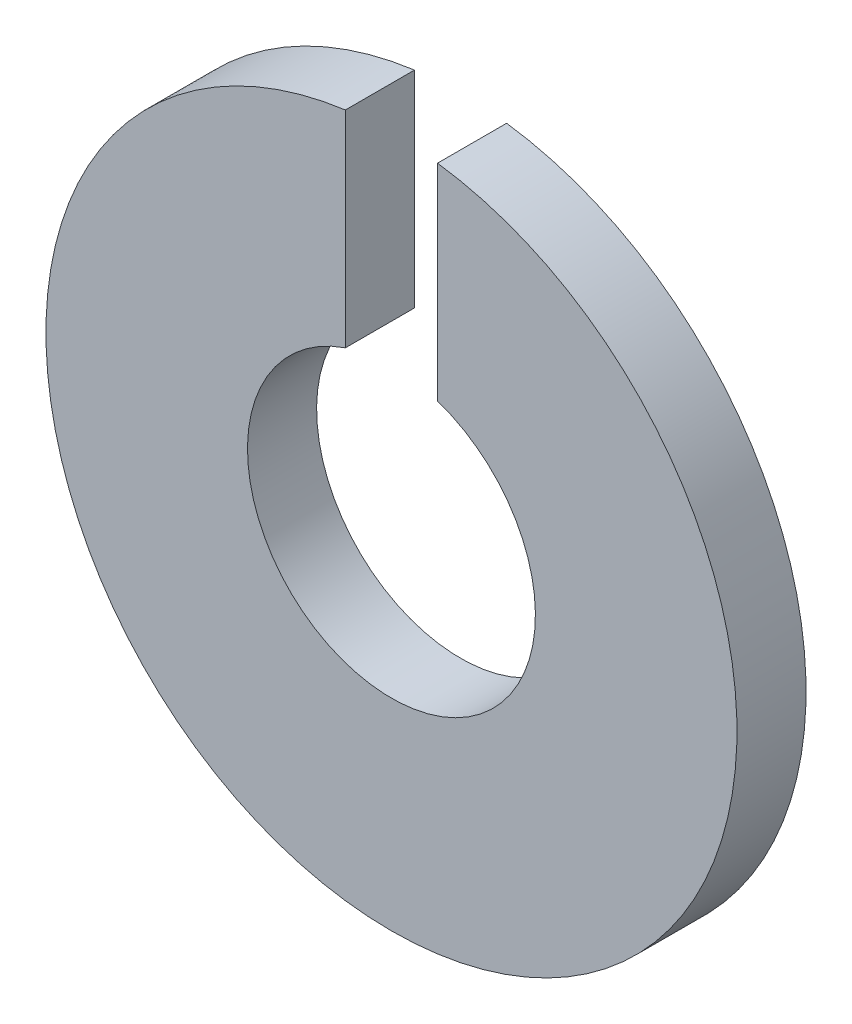
ISO-10303-21;
HEADER;
FILE_DESCRIPTION(('STEP AP214'),'2;1');
FILE_NAME('part.step','',(''),(''),'','','');
FILE_SCHEMA(('AUTOMOTIVE_DESIGN { 1 0 10303 214 1 1 1 1 }'));
ENDSEC;
DATA;
#1=APPLICATION_CONTEXT('core data for automotive mechanical design processes');
#2=APPLICATION_PROTOCOL_DEFINITION('international standard','automotive_design',2000,#1);
#3=PRODUCT_CONTEXT('',#1,'mechanical');
#4=PRODUCT('Part','Part','',(#3));
#5=PRODUCT_RELATED_PRODUCT_CATEGORY('part','',(#4));
#6=PRODUCT_DEFINITION_FORMATION('','',#4);
#7=PRODUCT_DEFINITION_CONTEXT('part definition',#1,'design');
#8=PRODUCT_DEFINITION('design','',#6,#7);
#9=PRODUCT_DEFINITION_SHAPE('','',#8);
#10=(LENGTH_UNIT() NAMED_UNIT(*) SI_UNIT(.MILLI.,.METRE.));
#11=(NAMED_UNIT(*) PLANE_ANGLE_UNIT() SI_UNIT($,.RADIAN.));
#12=(NAMED_UNIT(*) SI_UNIT($,.STERADIAN.) SOLID_ANGLE_UNIT());
#13=UNCERTAINTY_MEASURE_WITH_UNIT(LENGTH_MEASURE(1.E-05),#10,'distance_accuracy_value','');
#14=(GEOMETRIC_REPRESENTATION_CONTEXT(3) GLOBAL_UNCERTAINTY_ASSIGNED_CONTEXT((#13)) GLOBAL_UNIT_ASSIGNED_CONTEXT((#10,
#11,#12)) REPRESENTATION_CONTEXT('',''));
#15=CARTESIAN_POINT('',(0.,0.,0.));
#16=DIRECTION('',(0.,0.,1.));
#17=DIRECTION('',(1.,0.,0.));
#18=AXIS2_PLACEMENT_3D('',#15,#16,#17);
#19=CARTESIAN_POINT('',(0.,0.,6.));
#20=DIRECTION('',(0.,0.,1.));
#21=DIRECTION('',(1.,0.,0.));
#22=AXIS2_PLACEMENT_3D('',#19,#20,#21);
#23=PLANE('',#22);
#24=DIRECTION('',(0.,-1.,0.));
#25=VECTOR('',#24,1.);
#26=CARTESIAN_POINT('',(-4.00000000000001,0.,6.));
#27=LINE('',#26,#25);
#28=CARTESIAN_POINT('',(-4.00000000000001,29.732137494637,6.));
#29=VERTEX_POINT('',#28);
#30=CARTESIAN_POINT('',(-4.00000000000001,11.842719282327,6.));
#31=VERTEX_POINT('',#30);
#32=EDGE_CURVE('E63',#29,#31,#27,.T.);
#33=ORIENTED_EDGE('',*,*,#32,.F.);
#34=CARTESIAN_POINT('',(0.,0.,6.));
#35=DIRECTION('',(0.,0.,1.));
#36=DIRECTION('',(1.,0.,0.));
#37=AXIS2_PLACEMENT_3D('',#34,#35,#36);
#38=CIRCLE('',#37,30.);
#39=CARTESIAN_POINT('',(4.,29.732137494637,6.));
#40=VERTEX_POINT('',#39);
#41=EDGE_CURVE('E94',#29,#40,#38,.T.);
#42=ORIENTED_EDGE('',*,*,#41,.T.);
#43=DIRECTION('',(0.,1.,0.));
#44=VECTOR('',#43,1.);
#45=CARTESIAN_POINT('',(4.00000000000001,0.,6.));
#46=LINE('',#45,#44);
#47=CARTESIAN_POINT('',(4.,11.842719282327,6.));
#48=VERTEX_POINT('',#47);
#49=EDGE_CURVE('E97',#48,#40,#46,.T.);
#50=ORIENTED_EDGE('',*,*,#49,.F.);
#51=CARTESIAN_POINT('',(0.,0.,6.));
#52=DIRECTION('',(0.,0.,1.));
#53=DIRECTION('',(1.,0.,0.));
#54=AXIS2_PLACEMENT_3D('',#51,#52,#53);
#55=CIRCLE('',#54,12.5);
#56=EDGE_CURVE('E96',#31,#48,#55,.T.);
#57=ORIENTED_EDGE('',*,*,#56,.F.);
#58=EDGE_LOOP('',(#33,#42,#50,#57));
#59=FACE_BOUND('',#58,.T.);
#60=ADVANCED_FACE('F41',(#59),#23,.T.);
#61=CARTESIAN_POINT('',(0.,0.,0.));
#62=DIRECTION('',(0.,0.,1.));
#63=DIRECTION('',(1.,0.,0.));
#64=AXIS2_PLACEMENT_3D('',#61,#62,#63);
#65=PLANE('',#64);
#66=CARTESIAN_POINT('',(0.,0.,0.));
#67=DIRECTION('',(0.,0.,1.));
#68=DIRECTION('',(1.,0.,0.));
#69=AXIS2_PLACEMENT_3D('',#66,#67,#68);
#70=CIRCLE('',#69,30.);
#71=CARTESIAN_POINT('',(-4.00000000000001,29.732137494637,0.));
#72=VERTEX_POINT('',#71);
#73=CARTESIAN_POINT('',(4.,29.732137494637,0.));
#74=VERTEX_POINT('',#73);
#75=EDGE_CURVE('E100',#72,#74,#70,.T.);
#76=ORIENTED_EDGE('',*,*,#75,.F.);
#77=DIRECTION('',(0.,-1.,0.));
#78=VECTOR('',#77,1.);
#79=CARTESIAN_POINT('',(-4.00000000000001,0.,0.));
#80=LINE('',#79,#78);
#81=CARTESIAN_POINT('',(-4.00000000000001,11.842719282327,0.));
#82=VERTEX_POINT('',#81);
#83=EDGE_CURVE('E82',#72,#82,#80,.T.);
#84=ORIENTED_EDGE('',*,*,#83,.T.);
#85=CARTESIAN_POINT('',(0.,0.,0.));
#86=DIRECTION('',(0.,0.,1.));
#87=DIRECTION('',(1.,0.,0.));
#88=AXIS2_PLACEMENT_3D('',#85,#86,#87);
#89=CIRCLE('',#88,12.5);
#90=CARTESIAN_POINT('',(4.,11.842719282327,0.));
#91=VERTEX_POINT('',#90);
#92=EDGE_CURVE('E87',#82,#91,#89,.T.);
#93=ORIENTED_EDGE('',*,*,#92,.T.);
#94=DIRECTION('',(0.,1.,0.));
#95=VECTOR('',#94,1.);
#96=CARTESIAN_POINT('',(4.00000000000001,0.,0.));
#97=LINE('',#96,#95);
#98=EDGE_CURVE('E56',#91,#74,#97,.T.);
#99=ORIENTED_EDGE('',*,*,#98,.T.);
#100=EDGE_LOOP('',(#76,#84,#93,#99));
#101=FACE_BOUND('',#100,.T.);
#102=ADVANCED_FACE('F112',(#101),#65,.F.);
#103=CARTESIAN_POINT('',(0.,0.,6.));
#104=DIRECTION('',(0.,0.,-1.));
#105=DIRECTION('',(-1.,0.,0.));
#106=AXIS2_PLACEMENT_3D('',#103,#104,#105);
#107=CYLINDRICAL_SURFACE('',#106,30.);
#108=ORIENTED_EDGE('',*,*,#41,.F.);
#109=DIRECTION('',(0.,0.,-1.));
#110=VECTOR('',#109,1.);
#111=CARTESIAN_POINT('',(-4.00000000000001,29.732137494637,6.));
#112=LINE('',#111,#110);
#113=EDGE_CURVE('E79',#29,#72,#112,.T.);
#114=ORIENTED_EDGE('',*,*,#113,.T.);
#115=ORIENTED_EDGE('',*,*,#75,.T.);
#116=DIRECTION('',(0.,0.,-1.));
#117=VECTOR('',#116,1.);
#118=CARTESIAN_POINT('',(4.,29.732137494637,6.));
#119=LINE('',#118,#117);
#120=EDGE_CURVE('E88',#74,#40,#119,.F.);
#121=ORIENTED_EDGE('',*,*,#120,.T.);
#122=EDGE_LOOP('',(#108,#114,#115,#121));
#123=FACE_BOUND('',#122,.T.);
#124=ADVANCED_FACE('F43',(#123),#107,.T.);
#125=CARTESIAN_POINT('',(0.,0.,6.));
#126=DIRECTION('',(0.,0.,-1.));
#127=DIRECTION('',(-1.,0.,0.));
#128=AXIS2_PLACEMENT_3D('',#125,#126,#127);
#129=CYLINDRICAL_SURFACE('',#128,12.5);
#130=DIRECTION('',(0.,0.,-1.));
#131=VECTOR('',#130,1.);
#132=CARTESIAN_POINT('',(-4.00000000000001,11.842719282327,6.));
#133=LINE('',#132,#131);
#134=EDGE_CURVE('E11',#31,#82,#133,.T.);
#135=ORIENTED_EDGE('',*,*,#134,.F.);
#136=ORIENTED_EDGE('',*,*,#56,.T.);
#137=DIRECTION('',(0.,0.,-1.));
#138=VECTOR('',#137,1.);
#139=CARTESIAN_POINT('',(4.,11.842719282327,6.));
#140=LINE('',#139,#138);
#141=EDGE_CURVE('E49',#91,#48,#140,.F.);
#142=ORIENTED_EDGE('',*,*,#141,.F.);
#143=ORIENTED_EDGE('',*,*,#92,.F.);
#144=EDGE_LOOP('',(#135,#136,#142,#143));
#145=FACE_BOUND('',#144,.T.);
#146=ADVANCED_FACE('F114',(#145),#129,.F.);
#147=CARTESIAN_POINT('',(4.00000000000001,0.,0.));
#148=DIRECTION('',(1.,0.,0.));
#149=DIRECTION('',(0.,1.,0.));
#150=AXIS2_PLACEMENT_3D('',#147,#148,#149);
#151=PLANE('',#150);
#152=ORIENTED_EDGE('',*,*,#98,.F.);
#153=ORIENTED_EDGE('',*,*,#141,.T.);
#154=ORIENTED_EDGE('',*,*,#49,.T.);
#155=ORIENTED_EDGE('',*,*,#120,.F.);
#156=EDGE_LOOP('',(#152,#153,#154,#155));
#157=FACE_BOUND('',#156,.T.);
#158=ADVANCED_FACE('F115',(#157),#151,.F.);
#159=CARTESIAN_POINT('',(-4.00000000000001,0.,0.));
#160=DIRECTION('',(-1.,0.,0.));
#161=DIRECTION('',(0.,0.,1.));
#162=AXIS2_PLACEMENT_3D('',#159,#160,#161);
#163=PLANE('',#162);
#164=ORIENTED_EDGE('',*,*,#32,.T.);
#165=ORIENTED_EDGE('',*,*,#134,.T.);
#166=ORIENTED_EDGE('',*,*,#83,.F.);
#167=ORIENTED_EDGE('',*,*,#113,.F.);
#168=EDGE_LOOP('',(#164,#165,#166,#167));
#169=FACE_BOUND('',#168,.T.);
#170=ADVANCED_FACE('F80',(#169),#163,.F.);
#171=CLOSED_SHELL('',(#60,#102,#124,#146,#158,#170));
#172=MANIFOLD_SOLID_BREP('B2',#171);
#173=ADVANCED_BREP_SHAPE_REPRESENTATION('',(#18,#172),#14);
#174=SHAPE_DEFINITION_REPRESENTATION(#9,#173);
ENDSEC;
END-ISO-10303-21;
